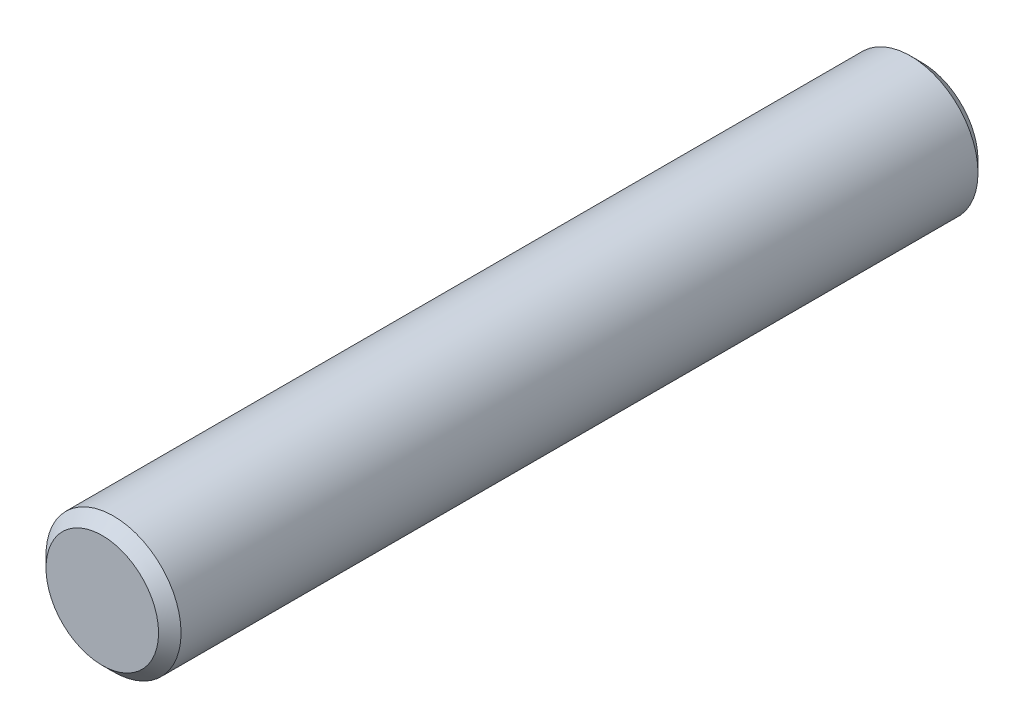
ISO-10303-21;
HEADER;
FILE_DESCRIPTION(('STEP AP214'),'2;1');
FILE_NAME('part.step','',(''),(''),'','','');
FILE_SCHEMA(('AUTOMOTIVE_DESIGN { 1 0 10303 214 1 1 1 1 }'));
ENDSEC;
DATA;
#1=APPLICATION_CONTEXT('core data for automotive mechanical design processes');
#2=APPLICATION_PROTOCOL_DEFINITION('international standard','automotive_design',2000,#1);
#3=PRODUCT_CONTEXT('',#1,'mechanical');
#4=PRODUCT('Part','Part','',(#3));
#5=PRODUCT_RELATED_PRODUCT_CATEGORY('part','',(#4));
#6=PRODUCT_DEFINITION_FORMATION('','',#4);
#7=PRODUCT_DEFINITION_CONTEXT('part definition',#1,'design');
#8=PRODUCT_DEFINITION('design','',#6,#7);
#9=PRODUCT_DEFINITION_SHAPE('','',#8);
#10=(LENGTH_UNIT() NAMED_UNIT(*) SI_UNIT(.MILLI.,.METRE.));
#11=(NAMED_UNIT(*) PLANE_ANGLE_UNIT() SI_UNIT($,.RADIAN.));
#12=(NAMED_UNIT(*) SI_UNIT($,.STERADIAN.) SOLID_ANGLE_UNIT());
#13=UNCERTAINTY_MEASURE_WITH_UNIT(LENGTH_MEASURE(1.E-05),#10,'distance_accuracy_value','');
#14=(GEOMETRIC_REPRESENTATION_CONTEXT(3) GLOBAL_UNCERTAINTY_ASSIGNED_CONTEXT((#13)) GLOBAL_UNIT_ASSIGNED_CONTEXT((#10,
#11,#12)) REPRESENTATION_CONTEXT('',''));
#15=CARTESIAN_POINT('',(0.,0.,0.));
#16=DIRECTION('',(0.,0.,1.));
#17=DIRECTION('',(1.,0.,0.));
#18=AXIS2_PLACEMENT_3D('',#15,#16,#17);
#19=CARTESIAN_POINT('',(0.,0.,36.40099384));
#20=DIRECTION('',(0.,0.,-1.));
#21=DIRECTION('',(-1.,0.,0.));
#22=AXIS2_PLACEMENT_3D('',#19,#20,#21);
#23=CYLINDRICAL_SURFACE('',#22,3.);
#24=CARTESIAN_POINT('',(0.,0.,0.500000000000007));
#25=DIRECTION('',(0.,0.,1.));
#26=DIRECTION('',(1.,0.,0.));
#27=AXIS2_PLACEMENT_3D('',#24,#25,#26);
#28=CIRCLE('',#27,3.);
#29=CARTESIAN_POINT('',(3.,0.,0.500000000000007));
#30=VERTEX_POINT('',#29);
#31=EDGE_CURVE('E59',#30,#30,#28,.T.);
#32=ORIENTED_EDGE('',*,*,#31,.T.);
#33=EDGE_LOOP('',(#32));
#34=FACE_BOUND('',#33,.T.);
#35=CARTESIAN_POINT('',(0.,0.,35.90099384));
#36=DIRECTION('',(0.,0.,1.));
#37=DIRECTION('',(1.,0.,0.));
#38=AXIS2_PLACEMENT_3D('',#35,#36,#37);
#39=CIRCLE('',#38,3.);
#40=CARTESIAN_POINT('',(3.,0.,35.90099384));
#41=VERTEX_POINT('',#40);
#42=EDGE_CURVE('E64',#41,#41,#39,.F.);
#43=ORIENTED_EDGE('',*,*,#42,.T.);
#44=EDGE_LOOP('',(#43));
#45=FACE_BOUND('',#44,.T.);
#46=ADVANCED_FACE('F45',(#34,#45),#23,.T.);
#47=CARTESIAN_POINT('',(0.,0.,36.40099384));
#48=DIRECTION('',(0.,0.,1.));
#49=DIRECTION('',(1.,0.,0.));
#50=AXIS2_PLACEMENT_3D('',#47,#48,#49);
#51=PLANE('',#50);
#52=CARTESIAN_POINT('',(0.,0.,36.40099384));
#53=DIRECTION('',(0.,0.,1.));
#54=DIRECTION('',(1.,0.,0.));
#55=AXIS2_PLACEMENT_3D('',#52,#53,#54);
#56=CIRCLE('',#55,2.50000000000001);
#57=CARTESIAN_POINT('',(2.50000000000001,0.,36.40099384));
#58=VERTEX_POINT('',#57);
#59=EDGE_CURVE('E10',#58,#58,#56,.T.);
#60=ORIENTED_EDGE('',*,*,#59,.T.);
#61=EDGE_LOOP('',(#60));
#62=FACE_BOUND('',#61,.T.);
#63=ADVANCED_FACE('F81',(#62),#51,.T.);
#64=CARTESIAN_POINT('',(0.,0.,0.));
#65=DIRECTION('',(0.,0.,1.));
#66=DIRECTION('',(1.,0.,0.));
#67=AXIS2_PLACEMENT_3D('',#64,#65,#66);
#68=PLANE('',#67);
#69=CARTESIAN_POINT('',(0.,0.,0.));
#70=DIRECTION('',(0.,0.,1.));
#71=DIRECTION('',(1.,0.,0.));
#72=AXIS2_PLACEMENT_3D('',#69,#70,#71);
#73=CIRCLE('',#72,2.5);
#74=CARTESIAN_POINT('',(2.5,0.,0.));
#75=VERTEX_POINT('',#74);
#76=EDGE_CURVE('E54',#75,#75,#73,.F.);
#77=ORIENTED_EDGE('',*,*,#76,.T.);
#78=EDGE_LOOP('',(#77));
#79=FACE_BOUND('',#78,.T.);
#80=ADVANCED_FACE('F78',(#79),#68,.F.);
#81=CARTESIAN_POINT('',(0.,0.,0.500000000000007));
#82=DIRECTION('',(0.,0.,1.));
#83=DIRECTION('',(1.,0.,0.));
#84=AXIS2_PLACEMENT_3D('',#81,#82,#83);
#85=CONICAL_SURFACE('',#84,3.,0.785398163397446);
#86=ORIENTED_EDGE('',*,*,#76,.F.);
#87=EDGE_LOOP('',(#86));
#88=FACE_BOUND('',#87,.T.);
#89=ORIENTED_EDGE('',*,*,#31,.F.);
#90=EDGE_LOOP('',(#89));
#91=FACE_BOUND('',#90,.T.);
#92=ADVANCED_FACE('F74',(#88,#91),#85,.T.);
#93=CARTESIAN_POINT('',(0.,0.,36.40099384));
#94=DIRECTION('',(0.,0.,-1.));
#95=DIRECTION('',(-1.,0.,0.));
#96=AXIS2_PLACEMENT_3D('',#93,#94,#95);
#97=CONICAL_SURFACE('',#96,2.50000000000001,0.78539816339745);
#98=ORIENTED_EDGE('',*,*,#42,.F.);
#99=EDGE_LOOP('',(#98));
#100=FACE_BOUND('',#99,.T.);
#101=ORIENTED_EDGE('',*,*,#59,.F.);
#102=EDGE_LOOP('',(#101));
#103=FACE_BOUND('',#102,.T.);
#104=ADVANCED_FACE('F48',(#100,#103),#97,.T.);
#105=CLOSED_SHELL('',(#46,#63,#80,#92,#104));
#106=MANIFOLD_SOLID_BREP('B2',#105);
#107=ADVANCED_BREP_SHAPE_REPRESENTATION('',(#18,#106),#14);
#108=SHAPE_DEFINITION_REPRESENTATION(#9,#107);
ENDSEC;
END-ISO-10303-21;
